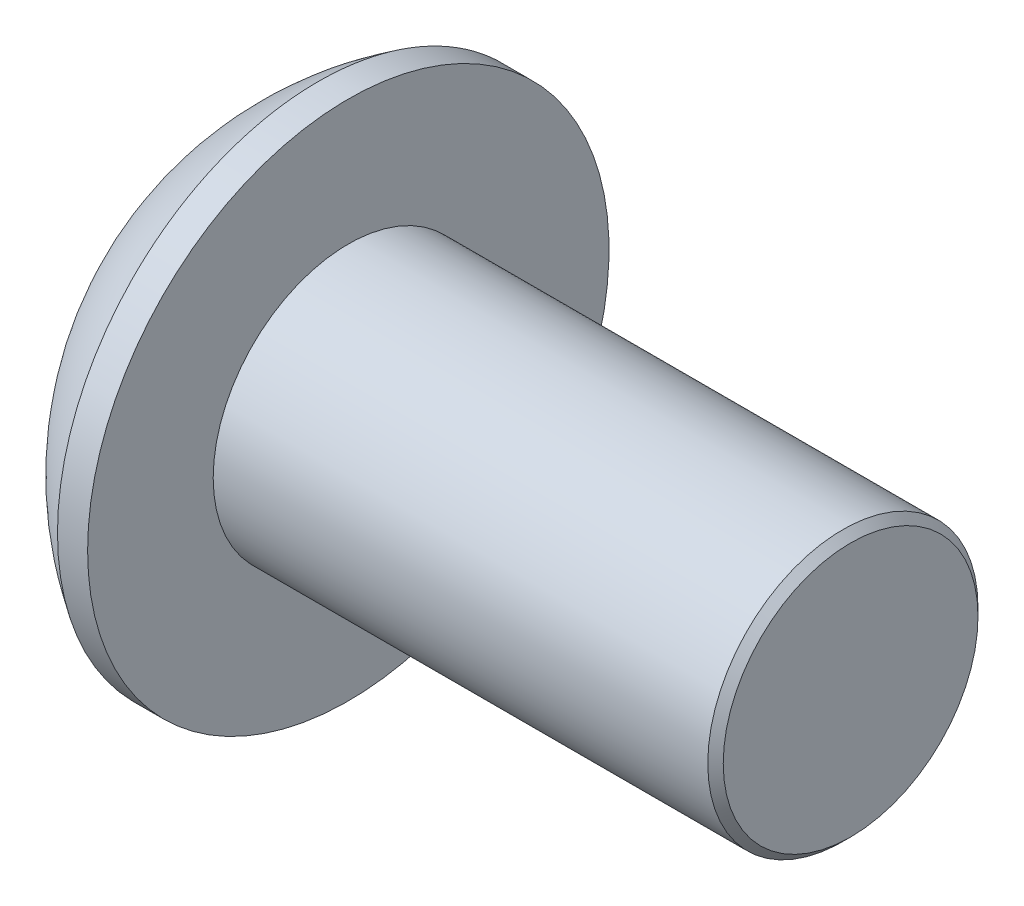
ISO-10303-21;
HEADER;
FILE_DESCRIPTION(('STEP AP214'),'2;1');
FILE_NAME('part.step','',(''),(''),'','','');
FILE_SCHEMA(('AUTOMOTIVE_DESIGN { 1 0 10303 214 1 1 1 1 }'));
ENDSEC;
DATA;
#1=APPLICATION_CONTEXT('core data for automotive mechanical design processes');
#2=APPLICATION_PROTOCOL_DEFINITION('international standard','automotive_design',2000,#1);
#3=PRODUCT_CONTEXT('',#1,'mechanical');
#4=PRODUCT('Part','Part','',(#3));
#5=PRODUCT_RELATED_PRODUCT_CATEGORY('part','',(#4));
#6=PRODUCT_DEFINITION_FORMATION('','',#4);
#7=PRODUCT_DEFINITION_CONTEXT('part definition',#1,'design');
#8=PRODUCT_DEFINITION('design','',#6,#7);
#9=PRODUCT_DEFINITION_SHAPE('','',#8);
#10=(LENGTH_UNIT() NAMED_UNIT(*) SI_UNIT(.MILLI.,.METRE.));
#11=(NAMED_UNIT(*) PLANE_ANGLE_UNIT() SI_UNIT($,.RADIAN.));
#12=(NAMED_UNIT(*) SI_UNIT($,.STERADIAN.) SOLID_ANGLE_UNIT());
#13=UNCERTAINTY_MEASURE_WITH_UNIT(LENGTH_MEASURE(1.E-05),#10,'distance_accuracy_value','');
#14=(GEOMETRIC_REPRESENTATION_CONTEXT(3) GLOBAL_UNCERTAINTY_ASSIGNED_CONTEXT((#13)) GLOBAL_UNIT_ASSIGNED_CONTEXT((#10,
#11,#12)) REPRESENTATION_CONTEXT('',''));
#15=CARTESIAN_POINT('',(0.,0.,0.));
#16=DIRECTION('',(0.,0.,1.));
#17=DIRECTION('',(1.,0.,0.));
#18=AXIS2_PLACEMENT_3D('',#15,#16,#17);
#19=CARTESIAN_POINT('',(1.32080000000034,0.,0.));
#20=DIRECTION('',(-1.,0.,0.));
#21=DIRECTION('',(0.,0.,1.));
#22=AXIS2_PLACEMENT_3D('',#19,#20,#21);
#23=CONICAL_SURFACE('',#22,1.1937999999998,1.04719755119608);
#24=CARTESIAN_POINT('',(2.01004075135902,0.,4.44089209850063E-13));
#25=VERTEX_POINT('',#24);
#26=VERTEX_LOOP('',#25);
#27=FACE_BOUND('',#26,.T.);
#28=CARTESIAN_POINT('',(1.32080000000009,0.,0.));
#29=DIRECTION('',(-1.,0.,0.));
#30=DIRECTION('',(0.,0.,1.));
#31=AXIS2_PLACEMENT_3D('',#28,#29,#30);
#32=CIRCLE('',#31,1.19380000000024);
#33=CARTESIAN_POINT('',(1.32080000000004,0.,1.19380000000012));
#34=VERTEX_POINT('',#33);
#35=CARTESIAN_POINT('',(1.32080000000004,-1.03386112703797,0.596900000000061));
#36=VERTEX_POINT('',#35);
#37=EDGE_CURVE('E20',#34,#36,#32,.F.);
#38=ORIENTED_EDGE('',*,*,#37,.F.);
#39=CARTESIAN_POINT('',(1.32080000000009,0.,0.));
#40=DIRECTION('',(-1.,0.,0.));
#41=DIRECTION('',(0.,0.,1.));
#42=AXIS2_PLACEMENT_3D('',#39,#40,#41);
#43=CIRCLE('',#42,1.19380000000024);
#44=CARTESIAN_POINT('',(1.32080000000004,1.03386112703797,0.596900000000063));
#45=VERTEX_POINT('',#44);
#46=EDGE_CURVE('E90',#45,#34,#43,.F.);
#47=ORIENTED_EDGE('',*,*,#46,.F.);
#48=CARTESIAN_POINT('',(1.32080000000009,0.,0.));
#49=DIRECTION('',(-1.,0.,0.));
#50=DIRECTION('',(0.,0.,1.));
#51=AXIS2_PLACEMENT_3D('',#48,#49,#50);
#52=CIRCLE('',#51,1.19380000000024);
#53=CARTESIAN_POINT('',(1.32080000000004,1.03386112703797,-0.596900000000063));
#54=VERTEX_POINT('',#53);
#55=EDGE_CURVE('E106',#54,#45,#52,.F.);
#56=ORIENTED_EDGE('',*,*,#55,.F.);
#57=CARTESIAN_POINT('',(1.32080000000009,0.,0.));
#58=DIRECTION('',(-1.,0.,0.));
#59=DIRECTION('',(0.,0.,1.));
#60=AXIS2_PLACEMENT_3D('',#57,#58,#59);
#61=CIRCLE('',#60,1.19380000000024);
#62=CARTESIAN_POINT('',(1.32080000000004,1.49420287879031E-12,-1.19380000000012));
#63=VERTEX_POINT('',#62);
#64=EDGE_CURVE('E449',#63,#54,#61,.F.);
#65=ORIENTED_EDGE('',*,*,#64,.F.);
#66=CARTESIAN_POINT('',(1.32080000000009,0.,0.));
#67=DIRECTION('',(-1.,0.,0.));
#68=DIRECTION('',(0.,0.,1.));
#69=AXIS2_PLACEMENT_3D('',#66,#67,#68);
#70=CIRCLE('',#69,1.19380000000024);
#71=CARTESIAN_POINT('',(1.32080000000004,-1.03386112703797,-0.596900000000062));
#72=VERTEX_POINT('',#71);
#73=EDGE_CURVE('E452',#72,#63,#70,.F.);
#74=ORIENTED_EDGE('',*,*,#73,.F.);
#75=CARTESIAN_POINT('',(1.32080000000009,0.,0.));
#76=DIRECTION('',(-1.,0.,0.));
#77=DIRECTION('',(0.,0.,1.));
#78=AXIS2_PLACEMENT_3D('',#75,#76,#77);
#79=CIRCLE('',#78,1.19380000000024);
#80=EDGE_CURVE('E93',#36,#72,#79,.F.);
#81=ORIENTED_EDGE('',*,*,#80,.F.);
#82=EDGE_LOOP('',(#38,#47,#56,#65,#74,#81));
#83=FACE_BOUND('',#82,.T.);
#84=ADVANCED_FACE('F17',(#27,#83),#23,.F.);
#85=CARTESIAN_POINT('',(1.3208,0.,2.3876));
#86=DIRECTION('',(-1.,0.,0.));
#87=DIRECTION('',(0.,0.,1.));
#88=AXIS2_PLACEMENT_3D('',#85,#86,#87);
#89=PLANE('',#88);
#90=DIRECTION('',(0.,1.,0.));
#91=VECTOR('',#90,1.);
#92=CARTESIAN_POINT('',(1.3208,-0.689240751358576,1.1938));
#93=LINE('',#92,#91);
#94=CARTESIAN_POINT('',(1.3208,-0.689240751358576,1.1938));
#95=VERTEX_POINT('',#94);
#96=EDGE_CURVE('E109',#34,#95,#93,.F.);
#97=ORIENTED_EDGE('',*,*,#96,.F.);
#98=ORIENTED_EDGE('',*,*,#37,.T.);
#99=DIRECTION('',(0.,0.5,0.866025403784439));
#100=VECTOR('',#99,1.);
#101=CARTESIAN_POINT('',(1.3208,-1.37848150271715,0.));
#102=LINE('',#101,#100);
#103=EDGE_CURVE('E112',#95,#36,#102,.F.);
#104=ORIENTED_EDGE('',*,*,#103,.F.);
#105=EDGE_LOOP('',(#97,#98,#104));
#106=FACE_BOUND('',#105,.T.);
#107=ADVANCED_FACE('F110',(#106),#89,.T.);
#108=CARTESIAN_POINT('',(1.3208,0.,2.3876));
#109=DIRECTION('',(-1.,0.,0.));
#110=DIRECTION('',(0.,0.,1.));
#111=AXIS2_PLACEMENT_3D('',#108,#109,#110);
#112=PLANE('',#111);
#113=DIRECTION('',(0.,0.5,0.866025403784439));
#114=VECTOR('',#113,1.);
#115=CARTESIAN_POINT('',(1.3208,-1.37848150271715,0.));
#116=LINE('',#115,#114);
#117=CARTESIAN_POINT('',(1.3208,-1.37848150271715,0.));
#118=VERTEX_POINT('',#117);
#119=EDGE_CURVE('E172',#36,#118,#116,.F.);
#120=ORIENTED_EDGE('',*,*,#119,.F.);
#121=ORIENTED_EDGE('',*,*,#80,.T.);
#122=DIRECTION('',(0.,-0.5,0.866025403784439));
#123=VECTOR('',#122,1.);
#124=CARTESIAN_POINT('',(1.3208,-0.689240751358576,-1.1938));
#125=LINE('',#124,#123);
#126=EDGE_CURVE('E160',#118,#72,#125,.F.);
#127=ORIENTED_EDGE('',*,*,#126,.F.);
#128=EDGE_LOOP('',(#120,#121,#127));
#129=FACE_BOUND('',#128,.T.);
#130=ADVANCED_FACE('F249',(#129),#112,.T.);
#131=CARTESIAN_POINT('',(1.3208,0.,2.3876));
#132=DIRECTION('',(-1.,0.,0.));
#133=DIRECTION('',(0.,0.,1.));
#134=AXIS2_PLACEMENT_3D('',#131,#132,#133);
#135=PLANE('',#134);
#136=DIRECTION('',(0.,-0.5,0.866025403784439));
#137=VECTOR('',#136,1.);
#138=CARTESIAN_POINT('',(1.3208,-0.689240751358576,-1.1938));
#139=LINE('',#138,#137);
#140=CARTESIAN_POINT('',(1.3208,-0.689240751358576,-1.1938));
#141=VERTEX_POINT('',#140);
#142=EDGE_CURVE('E157',#72,#141,#139,.F.);
#143=ORIENTED_EDGE('',*,*,#142,.F.);
#144=ORIENTED_EDGE('',*,*,#73,.T.);
#145=DIRECTION('',(0.,-1.,0.));
#146=VECTOR('',#145,1.);
#147=CARTESIAN_POINT('',(1.3208,0.689240751358575,-1.1938));
#148=LINE('',#147,#146);
#149=EDGE_CURVE('E144',#141,#63,#148,.F.);
#150=ORIENTED_EDGE('',*,*,#149,.F.);
#151=EDGE_LOOP('',(#143,#144,#150));
#152=FACE_BOUND('',#151,.T.);
#153=ADVANCED_FACE('F245',(#152),#135,.T.);
#154=CARTESIAN_POINT('',(1.3208,0.,2.3876));
#155=DIRECTION('',(-1.,0.,0.));
#156=DIRECTION('',(0.,0.,1.));
#157=AXIS2_PLACEMENT_3D('',#154,#155,#156);
#158=PLANE('',#157);
#159=DIRECTION('',(0.,-1.,0.));
#160=VECTOR('',#159,1.);
#161=CARTESIAN_POINT('',(1.3208,0.689240751358575,-1.1938));
#162=LINE('',#161,#160);
#163=CARTESIAN_POINT('',(1.3208,0.689240751358575,-1.1938));
#164=VERTEX_POINT('',#163);
#165=EDGE_CURVE('E141',#63,#164,#162,.F.);
#166=ORIENTED_EDGE('',*,*,#165,.F.);
#167=ORIENTED_EDGE('',*,*,#64,.T.);
#168=DIRECTION('',(0.,-0.500000000000001,-0.866025403784438));
#169=VECTOR('',#168,1.);
#170=CARTESIAN_POINT('',(1.3208,1.37848150271715,0.));
#171=LINE('',#170,#169);
#172=EDGE_CURVE('E129',#164,#54,#171,.F.);
#173=ORIENTED_EDGE('',*,*,#172,.F.);
#174=EDGE_LOOP('',(#166,#167,#173));
#175=FACE_BOUND('',#174,.T.);
#176=ADVANCED_FACE('F241',(#175),#158,.T.);
#177=CARTESIAN_POINT('',(1.3208,0.,2.3876));
#178=DIRECTION('',(-1.,0.,0.));
#179=DIRECTION('',(0.,0.,1.));
#180=AXIS2_PLACEMENT_3D('',#177,#178,#179);
#181=PLANE('',#180);
#182=DIRECTION('',(0.,-0.500000000000001,-0.866025403784438));
#183=VECTOR('',#182,1.);
#184=CARTESIAN_POINT('',(1.3208,1.37848150271715,0.));
#185=LINE('',#184,#183);
#186=CARTESIAN_POINT('',(1.3208,1.37848150271715,0.));
#187=VERTEX_POINT('',#186);
#188=EDGE_CURVE('E126',#54,#187,#185,.F.);
#189=ORIENTED_EDGE('',*,*,#188,.F.);
#190=ORIENTED_EDGE('',*,*,#55,.T.);
#191=DIRECTION('',(0.,0.500000000000001,-0.866025403784438));
#192=VECTOR('',#191,1.);
#193=CARTESIAN_POINT('',(1.3208,0.689240751358575,1.1938));
#194=LINE('',#193,#192);
#195=EDGE_CURVE('E149',#187,#45,#194,.F.);
#196=ORIENTED_EDGE('',*,*,#195,.F.);
#197=EDGE_LOOP('',(#189,#190,#196));
#198=FACE_BOUND('',#197,.T.);
#199=ADVANCED_FACE('F238',(#198),#181,.T.);
#200=CARTESIAN_POINT('',(1.3208,0.,2.3876));
#201=DIRECTION('',(-1.,0.,0.));
#202=DIRECTION('',(0.,0.,1.));
#203=AXIS2_PLACEMENT_3D('',#200,#201,#202);
#204=PLANE('',#203);
#205=DIRECTION('',(0.,0.500000000000001,-0.866025403784438));
#206=VECTOR('',#205,1.);
#207=CARTESIAN_POINT('',(1.3208,0.689240751358575,1.1938));
#208=LINE('',#207,#206);
#209=CARTESIAN_POINT('',(1.3208,0.689240751358575,1.1938));
#210=VERTEX_POINT('',#209);
#211=EDGE_CURVE('E104',#45,#210,#208,.F.);
#212=ORIENTED_EDGE('',*,*,#211,.F.);
#213=ORIENTED_EDGE('',*,*,#46,.T.);
#214=DIRECTION('',(0.,1.,0.));
#215=VECTOR('',#214,1.);
#216=CARTESIAN_POINT('',(1.3208,-0.689240751358576,1.1938));
#217=LINE('',#216,#215);
#218=EDGE_CURVE('E101',#210,#34,#217,.F.);
#219=ORIENTED_EDGE('',*,*,#218,.F.);
#220=EDGE_LOOP('',(#212,#213,#219));
#221=FACE_BOUND('',#220,.T.);
#222=ADVANCED_FACE('F99',(#221),#204,.T.);
#223=CARTESIAN_POINT('',(1.3208,-0.689240751358576,1.1938));
#224=DIRECTION('',(0.,0.,-1.));
#225=DIRECTION('',(0.,1.,0.));
#226=AXIS2_PLACEMENT_3D('',#223,#224,#225);
#227=PLANE('',#226);
#228=DIRECTION('',(0.,1.,0.));
#229=VECTOR('',#228,1.);
#230=CARTESIAN_POINT('',(0.,0.,1.1938));
#231=LINE('',#230,#229);
#232=CARTESIAN_POINT('',(0.,0.689240751358575,1.1938));
#233=VERTEX_POINT('',#232);
#234=CARTESIAN_POINT('',(0.,-0.689240751358576,1.1938));
#235=VERTEX_POINT('',#234);
#236=EDGE_CURVE('E133',#233,#235,#231,.F.);
#237=ORIENTED_EDGE('',*,*,#236,.F.);
#238=DIRECTION('',(1.,0.,0.));
#239=VECTOR('',#238,1.);
#240=CARTESIAN_POINT('',(1.3208,0.689240751358575,1.1938));
#241=LINE('',#240,#239);
#242=EDGE_CURVE('E118',#210,#233,#241,.F.);
#243=ORIENTED_EDGE('',*,*,#242,.F.);
#244=ORIENTED_EDGE('',*,*,#218,.T.);
#245=ORIENTED_EDGE('',*,*,#96,.T.);
#246=DIRECTION('',(1.,0.,0.));
#247=VECTOR('',#246,1.);
#248=CARTESIAN_POINT('',(1.3208,-0.689240751358576,1.1938));
#249=LINE('',#248,#247);
#250=EDGE_CURVE('E169',#235,#95,#249,.T.);
#251=ORIENTED_EDGE('',*,*,#250,.F.);
#252=EDGE_LOOP('',(#237,#243,#244,#245,#251));
#253=FACE_BOUND('',#252,.T.);
#254=ADVANCED_FACE('F116',(#253),#227,.T.);
#255=CARTESIAN_POINT('',(1.3208,-1.37848150271715,0.));
#256=DIRECTION('',(0.,0.866025403784439,-0.5));
#257=DIRECTION('',(0.,0.5,0.866025403784439));
#258=AXIS2_PLACEMENT_3D('',#255,#256,#257);
#259=PLANE('',#258);
#260=DIRECTION('',(0.,-0.5,-0.866025403784439));
#261=VECTOR('',#260,1.);
#262=CARTESIAN_POINT('',(0.,-0.689240751358576,1.1938));
#263=LINE('',#262,#261);
#264=CARTESIAN_POINT('',(0.,-1.37848150271715,0.));
#265=VERTEX_POINT('',#264);
#266=EDGE_CURVE('E436',#235,#265,#263,.T.);
#267=ORIENTED_EDGE('',*,*,#266,.F.);
#268=ORIENTED_EDGE('',*,*,#250,.T.);
#269=ORIENTED_EDGE('',*,*,#103,.T.);
#270=ORIENTED_EDGE('',*,*,#119,.T.);
#271=DIRECTION('',(1.,0.,0.));
#272=VECTOR('',#271,1.);
#273=CARTESIAN_POINT('',(1.3208,-1.37848150271715,0.));
#274=LINE('',#273,#272);
#275=EDGE_CURVE('E154',#265,#118,#274,.T.);
#276=ORIENTED_EDGE('',*,*,#275,.F.);
#277=EDGE_LOOP('',(#267,#268,#269,#270,#276));
#278=FACE_BOUND('',#277,.T.);
#279=ADVANCED_FACE('F229',(#278),#259,.T.);
#280=CARTESIAN_POINT('',(1.3208,-0.689240751358576,-1.1938));
#281=DIRECTION('',(0.,0.866025403784439,0.5));
#282=DIRECTION('',(0.,-0.5,0.866025403784439));
#283=AXIS2_PLACEMENT_3D('',#280,#281,#282);
#284=PLANE('',#283);
#285=DIRECTION('',(0.,0.5,-0.866025403784439));
#286=VECTOR('',#285,1.);
#287=CARTESIAN_POINT('',(0.,-1.37848150271715,0.));
#288=LINE('',#287,#286);
#289=CARTESIAN_POINT('',(0.,-0.689240751358576,-1.1938));
#290=VERTEX_POINT('',#289);
#291=EDGE_CURVE('E433',#265,#290,#288,.T.);
#292=ORIENTED_EDGE('',*,*,#291,.F.);
#293=ORIENTED_EDGE('',*,*,#275,.T.);
#294=ORIENTED_EDGE('',*,*,#126,.T.);
#295=ORIENTED_EDGE('',*,*,#142,.T.);
#296=DIRECTION('',(1.,0.,0.));
#297=VECTOR('',#296,1.);
#298=CARTESIAN_POINT('',(1.3208,-0.689240751358576,-1.1938));
#299=LINE('',#298,#297);
#300=EDGE_CURVE('E138',#290,#141,#299,.T.);
#301=ORIENTED_EDGE('',*,*,#300,.F.);
#302=EDGE_LOOP('',(#292,#293,#294,#295,#301));
#303=FACE_BOUND('',#302,.T.);
#304=ADVANCED_FACE('F225',(#303),#284,.T.);
#305=CARTESIAN_POINT('',(1.3208,0.689240751358575,-1.1938));
#306=DIRECTION('',(0.,0.,1.));
#307=DIRECTION('',(0.,-1.,0.));
#308=AXIS2_PLACEMENT_3D('',#305,#306,#307);
#309=PLANE('',#308);
#310=DIRECTION('',(0.,1.,0.));
#311=VECTOR('',#310,1.);
#312=CARTESIAN_POINT('',(0.,0.,-1.1938));
#313=LINE('',#312,#311);
#314=CARTESIAN_POINT('',(0.,0.689240751358575,-1.1938));
#315=VERTEX_POINT('',#314);
#316=EDGE_CURVE('E430',#290,#315,#313,.T.);
#317=ORIENTED_EDGE('',*,*,#316,.F.);
#318=ORIENTED_EDGE('',*,*,#300,.T.);
#319=ORIENTED_EDGE('',*,*,#149,.T.);
#320=ORIENTED_EDGE('',*,*,#165,.T.);
#321=DIRECTION('',(1.,0.,0.));
#322=VECTOR('',#321,1.);
#323=CARTESIAN_POINT('',(1.3208,0.689240751358575,-1.1938));
#324=LINE('',#323,#322);
#325=EDGE_CURVE('E128',#315,#164,#324,.T.);
#326=ORIENTED_EDGE('',*,*,#325,.F.);
#327=EDGE_LOOP('',(#317,#318,#319,#320,#326));
#328=FACE_BOUND('',#327,.T.);
#329=ADVANCED_FACE('F222',(#328),#309,.T.);
#330=CARTESIAN_POINT('',(1.3208,1.37848150271715,0.));
#331=DIRECTION('',(0.,-0.866025403784438,0.500000000000001));
#332=DIRECTION('',(0.,-0.500000000000001,-0.866025403784438));
#333=AXIS2_PLACEMENT_3D('',#330,#331,#332);
#334=PLANE('',#333);
#335=DIRECTION('',(0.,0.500000000000001,0.866025403784438));
#336=VECTOR('',#335,1.);
#337=CARTESIAN_POINT('',(0.,0.689240751358575,-1.1938));
#338=LINE('',#337,#336);
#339=CARTESIAN_POINT('',(0.,1.37848150271715,0.));
#340=VERTEX_POINT('',#339);
#341=EDGE_CURVE('E427',#315,#340,#338,.T.);
#342=ORIENTED_EDGE('',*,*,#341,.F.);
#343=ORIENTED_EDGE('',*,*,#325,.T.);
#344=ORIENTED_EDGE('',*,*,#172,.T.);
#345=ORIENTED_EDGE('',*,*,#188,.T.);
#346=DIRECTION('',(1.,0.,0.));
#347=VECTOR('',#346,1.);
#348=CARTESIAN_POINT('',(1.3208,1.37848150271715,0.));
#349=LINE('',#348,#347);
#350=EDGE_CURVE('E35',#340,#187,#349,.T.);
#351=ORIENTED_EDGE('',*,*,#350,.F.);
#352=EDGE_LOOP('',(#342,#343,#344,#345,#351));
#353=FACE_BOUND('',#352,.T.);
#354=ADVANCED_FACE('F218',(#353),#334,.T.);
#355=CARTESIAN_POINT('',(1.3208,0.689240751358575,1.1938));
#356=DIRECTION('',(0.,-0.866025403784438,-0.500000000000001));
#357=DIRECTION('',(0.,0.500000000000001,-0.866025403784438));
#358=AXIS2_PLACEMENT_3D('',#355,#356,#357);
#359=PLANE('',#358);
#360=DIRECTION('',(0.,-0.500000000000001,0.866025403784438));
#361=VECTOR('',#360,1.);
#362=CARTESIAN_POINT('',(0.,1.37848150271715,0.));
#363=LINE('',#362,#361);
#364=EDGE_CURVE('E204',#340,#233,#363,.T.);
#365=ORIENTED_EDGE('',*,*,#364,.F.);
#366=ORIENTED_EDGE('',*,*,#350,.T.);
#367=ORIENTED_EDGE('',*,*,#195,.T.);
#368=ORIENTED_EDGE('',*,*,#211,.T.);
#369=ORIENTED_EDGE('',*,*,#242,.T.);
#370=EDGE_LOOP('',(#365,#366,#367,#368,#369));
#371=FACE_BOUND('',#370,.T.);
#372=ADVANCED_FACE('F214',(#371),#359,.T.);
#373=CARTESIAN_POINT('',(0.,0.,0.));
#374=DIRECTION('',(-1.,0.,0.));
#375=DIRECTION('',(0.,0.,1.));
#376=AXIS2_PLACEMENT_3D('',#373,#374,#375);
#377=PLANE('',#376);
#378=ORIENTED_EDGE('',*,*,#341,.T.);
#379=ORIENTED_EDGE('',*,*,#364,.T.);
#380=ORIENTED_EDGE('',*,*,#236,.T.);
#381=ORIENTED_EDGE('',*,*,#266,.T.);
#382=ORIENTED_EDGE('',*,*,#291,.T.);
#383=ORIENTED_EDGE('',*,*,#316,.T.);
#384=EDGE_LOOP('',(#378,#379,#380,#381,#382,#383));
#385=FACE_BOUND('',#384,.T.);
#386=CARTESIAN_POINT('',(0.,1.647825,0.));
#387=CARTESIAN_POINT('',(1.63763925918252E-13,1.64781976319874,0.0924902039777531));
#388=CARTESIAN_POINT('',(1.32702949606854E-13,1.63999511633709,0.18514501432637));
#389=CARTESIAN_POINT('',(0.,1.6167119250047,0.322075808080014));
#390=CARTESIAN_POINT('',(-1.58596022451816E-13,1.60700618770234,0.367435533396361));
#391=CARTESIAN_POINT('',(1.5872499243493E-13,1.58380101865853,0.45722093569514));
#392=CARTESIAN_POINT('',(5.68523994290649E-13,1.5702985083103,0.501645823115263));
#393=CARTESIAN_POINT('',(9.36228728749825E-13,1.52428156574313,0.632817459278967));
#394=CARTESIAN_POINT('',(0.,1.48621992666366,0.717681965518643));
#395=CARTESIAN_POINT('',(0.,1.39637079695658,0.879809706624016));
#396=CARTESIAN_POINT('',(7.82315428745167E-13,1.34458278455109,0.957072652379993));
#397=CARTESIAN_POINT('',(4.86917074274052E-13,1.25777784714521,1.06558770210237));
#398=CARTESIAN_POINT('',(1.33283514379352E-13,1.22729946114793,1.10054993332365));
#399=CARTESIAN_POINT('',(-1.3315500899694E-13,1.16354004969106,1.16775237388221));
#400=CARTESIAN_POINT('',(0.,1.13026175473033,1.19999517515816));
#401=CARTESIAN_POINT('',(0.,1.02649304340867,1.29236218866442));
#402=CARTESIAN_POINT('',(0.,0.952049986714078,1.34814848277713));
#403=CARTESIAN_POINT('',(0.,0.794895196754069,1.44639825105766));
#404=CARTESIAN_POINT('',(0.,0.712183775431296,1.48886222758992));
#405=CARTESIAN_POINT('',(0.,0.540796624265729,1.55930919813143));
#406=CARTESIAN_POINT('',(0.,0.452120958135285,1.58729234680268));
#407=CARTESIAN_POINT('',(0.,0.271332331080316,1.62797191307413));
#408=CARTESIAN_POINT('',(0.,0.179219351801788,1.64066824903626));
#409=CARTESIAN_POINT('',(0.,-0.00583077027840854,1.65041748705409));
#410=CARTESIAN_POINT('',(0.,-0.0987679130800777,1.64747038910979));
#411=CARTESIAN_POINT('',(0.,-0.282830196388824,1.62601274134436));
#412=CARTESIAN_POINT('',(0.,-0.373955346570018,1.60750227463794));
#413=CARTESIAN_POINT('',(0.,-0.551796068178804,1.55545413364524));
#414=CARTESIAN_POINT('',(0.,-0.638511592498166,1.52191629885844));
#415=CARTESIAN_POINT('',(0.,-0.805120175533153,1.44072378052347));
#416=CARTESIAN_POINT('',(0.,-0.885012976819956,1.39306856461393));
#417=CARTESIAN_POINT('',(0.,-0.99791287958836,1.31211658756413));
#418=CARTESIAN_POINT('',(0.,-1.0343949246834,1.28354906167734));
#419=CARTESIAN_POINT('',(0.,-1.10486279842069,1.22341829303709));
#420=CARTESIAN_POINT('',(0.,-1.13884618403291,1.19185218578117));
#421=CARTESIAN_POINT('',(0.,-1.23657300939909,1.09305906467359));
#422=CARTESIAN_POINT('',(0.,-1.29619288399357,1.02166556658613));
#423=CARTESIAN_POINT('',(0.,-1.40258050817756,0.869876423478034));
#424=CARTESIAN_POINT('',(0.,-1.44934874627766,0.789481120793479));
#425=CARTESIAN_POINT('',(0.,-1.50889406070375,0.663870959313342));
#426=CARTESIAN_POINT('',(0.,-1.52698985473587,0.621110806760429));
#427=CARTESIAN_POINT('',(0.,-1.55950093966664,0.534260776864333));
#428=CARTESIAN_POINT('',(-1.05232299521477E-13,-1.57391920916438,0.49017200820317));
#429=CARTESIAN_POINT('',(2.09912830260247E-13,-1.61146177909579,0.356445777718599));
#430=CARTESIAN_POINT('',(1.14253880703177E-12,-1.62897899568075,0.265126085962908));
#431=CARTESIAN_POINT('',(4.34042593339461E-13,-1.64174347214909,0.144386595969389));
#432=CARTESIAN_POINT('',(1.21296184696852E-13,-1.64402207668916,0.115560405797875));
#433=CARTESIAN_POINT('',(-1.21296184696927E-13,-1.64706365940121,0.05782817572527));
#434=CARTESIAN_POINT('',(0.,-1.64782663757319,0.0289221358241781));
#435=CARTESIAN_POINT('',(1.63547654055969E-13,-1.64781976319875,-0.0924902039777535));
#436=CARTESIAN_POINT('',(1.3266850667884E-13,-1.6399951163371,-0.18514501432637));
#437=CARTESIAN_POINT('',(0.,-1.61671192500471,-0.322075808080013));
#438=CARTESIAN_POINT('',(-1.58598529451188E-13,-1.60700618770235,-0.36743553339636));
#439=CARTESIAN_POINT('',(1.58727501472989E-13,-1.58380101865854,-0.457220935695139));
#440=CARTESIAN_POINT('',(5.68551329349222E-13,-1.57029850831031,-0.501645823115263));
#441=CARTESIAN_POINT('',(9.36174188935675E-13,-1.52428156574314,-0.632817459278966));
#442=CARTESIAN_POINT('',(0.,-1.48621992666367,-0.717681965518643));
#443=CARTESIAN_POINT('',(0.,-1.39637079695659,-0.879809706624016));
#444=CARTESIAN_POINT('',(7.83527879222532E-13,-1.3445827845511,-0.957072652379995));
#445=CARTESIAN_POINT('',(4.87611665544768E-13,-1.25777784714522,-1.06558770210237));
#446=CARTESIAN_POINT('',(1.33494322539577E-13,-1.22729946114795,-1.10054993332365));
#447=CARTESIAN_POINT('',(-1.33365613906348E-13,-1.16354004969107,-1.16775237388221));
#448=CARTESIAN_POINT('',(0.,-1.13026175473034,-1.19999517515816));
#449=CARTESIAN_POINT('',(0.,-1.02649304340868,-1.29236218866442));
#450=CARTESIAN_POINT('',(0.,-0.952049986714089,-1.34814848277713));
#451=CARTESIAN_POINT('',(0.,-0.79489519675408,-1.44639825105766));
#452=CARTESIAN_POINT('',(0.,-0.712183775431308,-1.48886222758992));
#453=CARTESIAN_POINT('',(0.,-0.540796624265741,-1.55930919813143));
#454=CARTESIAN_POINT('',(0.,-0.452120958135297,-1.58729234680268));
#455=CARTESIAN_POINT('',(0.,-0.271332331080328,-1.62797191307413));
#456=CARTESIAN_POINT('',(0.,-0.179219351801799,-1.64066824903626));
#457=CARTESIAN_POINT('',(0.,0.00583077027839798,-1.65041748705409));
#458=CARTESIAN_POINT('',(0.,0.0987679130800672,-1.64747038910979));
#459=CARTESIAN_POINT('',(0.,0.282830196388814,-1.62601274134436));
#460=CARTESIAN_POINT('',(0.,0.373955346570008,-1.60750227463794));
#461=CARTESIAN_POINT('',(0.,0.551796068178794,-1.55545413364524));
#462=CARTESIAN_POINT('',(0.,0.638511592498155,-1.52191629885844));
#463=CARTESIAN_POINT('',(0.,0.805120175533142,-1.44072378052347));
#464=CARTESIAN_POINT('',(0.,0.885012976819945,-1.39306856461393));
#465=CARTESIAN_POINT('',(0.,0.997912879588349,-1.31211658756413));
#466=CARTESIAN_POINT('',(0.,1.03439492468339,-1.28354906167735));
#467=CARTESIAN_POINT('',(0.,1.10486279842068,-1.2234182930371));
#468=CARTESIAN_POINT('',(0.,1.1388461840329,-1.19185218578118));
#469=CARTESIAN_POINT('',(0.,1.23657300939907,-1.09305906467359));
#470=CARTESIAN_POINT('',(0.,1.29619288399356,-1.02166556658613));
#471=CARTESIAN_POINT('',(0.,1.40258050817755,-0.869876423478035));
#472=CARTESIAN_POINT('',(0.,1.44934874627765,-0.78948112079348));
#473=CARTESIAN_POINT('',(0.,1.50889406070374,-0.663870959313343));
#474=CARTESIAN_POINT('',(0.,1.52698985473586,-0.62111080676043));
#475=CARTESIAN_POINT('',(0.,1.55950093966663,-0.534260776864334));
#476=CARTESIAN_POINT('',(-1.0532011787629E-13,1.57391920916437,-0.490172008203172));
#477=CARTESIAN_POINT('',(2.10088006508332E-13,1.61146177909578,-0.3564457777186));
#478=CARTESIAN_POINT('',(1.14416805280189E-12,1.62897899568074,-0.26512608596291));
#479=CARTESIAN_POINT('',(4.34671710241649E-13,1.64174347214908,-0.144386595969391));
#480=CARTESIAN_POINT('',(1.21470371237733E-13,1.64402207668915,-0.115560405797877));
#481=CARTESIAN_POINT('',(-1.21470371237808E-13,1.6470636594012,-0.0578281757252714));
#482=CARTESIAN_POINT('',(0.,1.64782663757318,-0.0289221358241792));
#483=CARTESIAN_POINT('',(0.,1.647825,0.));
#484=B_SPLINE_CURVE_WITH_KNOTS('',3,(#386,#387,#388,#389,#390,#391,#392,#393,#394,#395,#396,
#397,#398,#399,#400,#401,#402,#403,#404,#405,#406,#407,#408,#409,#410,#411,#412,#413,#414,#415,
#416,#417,#418,#419,#420,#421,#422,#423,#424,#425,#426,#427,#428,#429,#430,#431,#432,#433,#434,
#435,#436,#437,#438,#439,#440,#441,#442,#443,#444,#445,#446,#447,#448,#449,#450,#451,#452,#453,
#454,#455,#456,#457,#458,#459,#460,#461,#462,#463,#464,#465,#466,#467,#468,#469,#470,#471,#472,
#473,#474,#475,#476,#477,#478,#479,#480,#481,#482,#483),.UNSPECIFIED.,.T.,.F.,(4,2,2,2,2,2,2,2,
2,2,2,2,2,2,2,2,2,2,2,2,2,2,2,2,2,2,2,2,2,2,2,2,2,2,2,2,2,2,2,2,2,2,2,2,2,2,2,2,4),(0.,
0.277336029422426,0.416368541537111,0.5555141146256,0.833141970294986,1.11078038089036,
1.24978149120748,1.38864858351854,1.66629367015056,1.94392828594775,2.22155993641642,
2.49919306954937,2.77682620268234,3.05445785315101,3.3320924689482,3.6097375555799,
3.74860464789074,3.88760575820768,4.16524416880333,4.44287202447288,4.58201759756161,
4.72105010967662,4.99838613909883,5.08511046196677,5.17183478483477,5.4491708142572,
5.58820332637188,5.72734889946037,6.00497675512976,6.28261516572513,6.42161627604225,
6.56048336835331,6.83812845498533,7.11576307078252,7.39339472125119,7.67102785438414,
7.94866098751711,8.22629263798579,8.50392725378297,8.78157234041467,8.92043943272551,
9.05944054304245,9.3370789536381,9.61470680930765,9.75385238239638,9.8928848945114,
10.1702209239336,10.2569452468015,10.3436695696695),.UNSPECIFIED.);
#485=CARTESIAN_POINT('',(0.,1.647825,0.));
#486=VERTEX_POINT('',#485);
#487=EDGE_CURVE('E198',#486,#486,#484,.T.);
#488=ORIENTED_EDGE('',*,*,#487,.F.);
#489=EDGE_LOOP('',(#488));
#490=FACE_BOUND('',#489,.T.);
#491=ADVANCED_FACE('F210',(#385,#490),#377,.T.);
#492=CARTESIAN_POINT('',(3.50132362607759,0.,0.));
#493=DIRECTION('',(0.,1.,0.));
#494=DIRECTION('',(1.,0.,0.));
#495=AXIS2_PLACEMENT_3D('',#492,#493,#494);
#496=SPHERICAL_SURFACE('',#495,3.86970210289554);
#497=CARTESIAN_POINT('',(1.4732,0.,0.));
#498=DIRECTION('',(-1.,0.,0.));
#499=DIRECTION('',(0.,0.,1.));
#500=AXIS2_PLACEMENT_3D('',#497,#498,#499);
#501=CIRCLE('',#500,3.29565);
#502=CARTESIAN_POINT('',(1.4732,0.,3.29565));
#503=VERTEX_POINT('',#502);
#504=EDGE_CURVE('E195',#503,#503,#501,.F.);
#505=ORIENTED_EDGE('',*,*,#504,.F.);
#506=EDGE_LOOP('',(#505));
#507=FACE_BOUND('',#506,.T.);
#508=ORIENTED_EDGE('',*,*,#487,.T.);
#509=EDGE_LOOP('',(#508));
#510=FACE_BOUND('',#509,.T.);
#511=ADVANCED_FACE('F206',(#507,#510),#496,.T.);
#512=CARTESIAN_POINT('',(8.2042,0.,0.));
#513=DIRECTION('',(-1.,0.,0.));
#514=DIRECTION('',(0.,0.,1.));
#515=AXIS2_PLACEMENT_3D('',#512,#513,#514);
#516=PLANE('',#515);
#517=CARTESIAN_POINT('',(8.20420000002287,0.,0.));
#518=DIRECTION('',(-1.,0.,0.));
#519=DIRECTION('',(0.,0.,1.));
#520=AXIS2_PLACEMENT_3D('',#517,#518,#519);
#521=CIRCLE('',#520,1.61035999991554);
#522=CARTESIAN_POINT('',(8.20420000002287,0.,1.61035999991554));
#523=VERTEX_POINT('',#522);
#524=EDGE_CURVE('E192',#523,#523,#521,.T.);
#525=ORIENTED_EDGE('',*,*,#524,.F.);
#526=EDGE_LOOP('',(#525));
#527=FACE_BOUND('',#526,.T.);
#528=ADVANCED_FACE('F277',(#527),#516,.F.);
#529=CARTESIAN_POINT('',(0.,0.,0.));
#530=DIRECTION('',(-1.,0.,0.));
#531=DIRECTION('',(0.,0.,1.));
#532=AXIS2_PLACEMENT_3D('',#529,#530,#531);
#533=CYLINDRICAL_SURFACE('',#532,3.29565);
#534=ORIENTED_EDGE('',*,*,#504,.T.);
#535=EDGE_LOOP('',(#534));
#536=FACE_BOUND('',#535,.T.);
#537=CARTESIAN_POINT('',(1.8542,0.,0.));
#538=DIRECTION('',(-1.,0.,0.));
#539=DIRECTION('',(0.,0.,1.));
#540=AXIS2_PLACEMENT_3D('',#537,#538,#539);
#541=CIRCLE('',#540,3.29565);
#542=CARTESIAN_POINT('',(1.8542,0.,3.29565));
#543=VERTEX_POINT('',#542);
#544=EDGE_CURVE('E189',#543,#543,#541,.T.);
#545=ORIENTED_EDGE('',*,*,#544,.T.);
#546=EDGE_LOOP('',(#545));
#547=FACE_BOUND('',#546,.T.);
#548=ADVANCED_FACE('F274',(#536,#547),#533,.T.);
#549=CARTESIAN_POINT('',(8.10640999998213,0.,0.));
#550=DIRECTION('',(-1.,0.,0.));
#551=DIRECTION('',(0.,0.,1.));
#552=AXIS2_PLACEMENT_3D('',#549,#550,#551);
#553=CONICAL_SURFACE('',#552,1.70815000001312,0.785398163688089);
#554=CARTESIAN_POINT('',(8.10641000000003,0.,0.));
#555=DIRECTION('',(-1.,0.,0.));
#556=DIRECTION('',(0.,0.,1.));
#557=AXIS2_PLACEMENT_3D('',#554,#555,#556);
#558=CIRCLE('',#557,1.70814999999999);
#559=CARTESIAN_POINT('',(8.10641000000003,0.,1.70814999999999));
#560=VERTEX_POINT('',#559);
#561=EDGE_CURVE('E26',#560,#560,#558,.T.);
#562=ORIENTED_EDGE('',*,*,#561,.F.);
#563=EDGE_LOOP('',(#562));
#564=FACE_BOUND('',#563,.T.);
#565=ORIENTED_EDGE('',*,*,#524,.T.);
#566=EDGE_LOOP('',(#565));
#567=FACE_BOUND('',#566,.T.);
#568=ADVANCED_FACE('F267',(#564,#567),#553,.T.);
#569=CARTESIAN_POINT('',(1.8542,1.70814999999999,0.));
#570=DIRECTION('',(-1.,0.,0.));
#571=DIRECTION('',(0.,0.,1.));
#572=AXIS2_PLACEMENT_3D('',#569,#570,#571);
#573=PLANE('',#572);
#574=CARTESIAN_POINT('',(1.8542,0.,0.));
#575=DIRECTION('',(-1.,0.,0.));
#576=DIRECTION('',(0.,0.,1.));
#577=AXIS2_PLACEMENT_3D('',#574,#575,#576);
#578=CIRCLE('',#577,1.70814999999999);
#579=CARTESIAN_POINT('',(1.8542,0.,1.70814999999999));
#580=VERTEX_POINT('',#579);
#581=EDGE_CURVE('E11',#580,#580,#578,.F.);
#582=ORIENTED_EDGE('',*,*,#581,.F.);
#583=EDGE_LOOP('',(#582));
#584=FACE_BOUND('',#583,.T.);
#585=ORIENTED_EDGE('',*,*,#544,.F.);
#586=EDGE_LOOP('',(#585));
#587=FACE_BOUND('',#586,.T.);
#588=ADVANCED_FACE('F261',(#584,#587),#573,.F.);
#589=CARTESIAN_POINT('',(0.,0.,0.));
#590=DIRECTION('',(-1.,0.,0.));
#591=DIRECTION('',(0.,0.,1.));
#592=AXIS2_PLACEMENT_3D('',#589,#590,#591);
#593=CYLINDRICAL_SURFACE('',#592,1.70814999999999);
#594=ORIENTED_EDGE('',*,*,#581,.T.);
#595=EDGE_LOOP('',(#594));
#596=FACE_BOUND('',#595,.T.);
#597=ORIENTED_EDGE('',*,*,#561,.T.);
#598=EDGE_LOOP('',(#597));
#599=FACE_BOUND('',#598,.T.);
#600=ADVANCED_FACE('F259',(#596,#599),#593,.T.);
#601=CLOSED_SHELL('',(#84,#107,#130,#153,#176,#199,#222,#254,#279,#304,#329,#354,#372,#491,#511,
#528,#548,#568,#588,#600));
#602=MANIFOLD_SOLID_BREP('B1',#601);
#603=ADVANCED_BREP_SHAPE_REPRESENTATION('',(#18,#602),#14);
#604=SHAPE_DEFINITION_REPRESENTATION(#9,#603);
ENDSEC;
END-ISO-10303-21;
